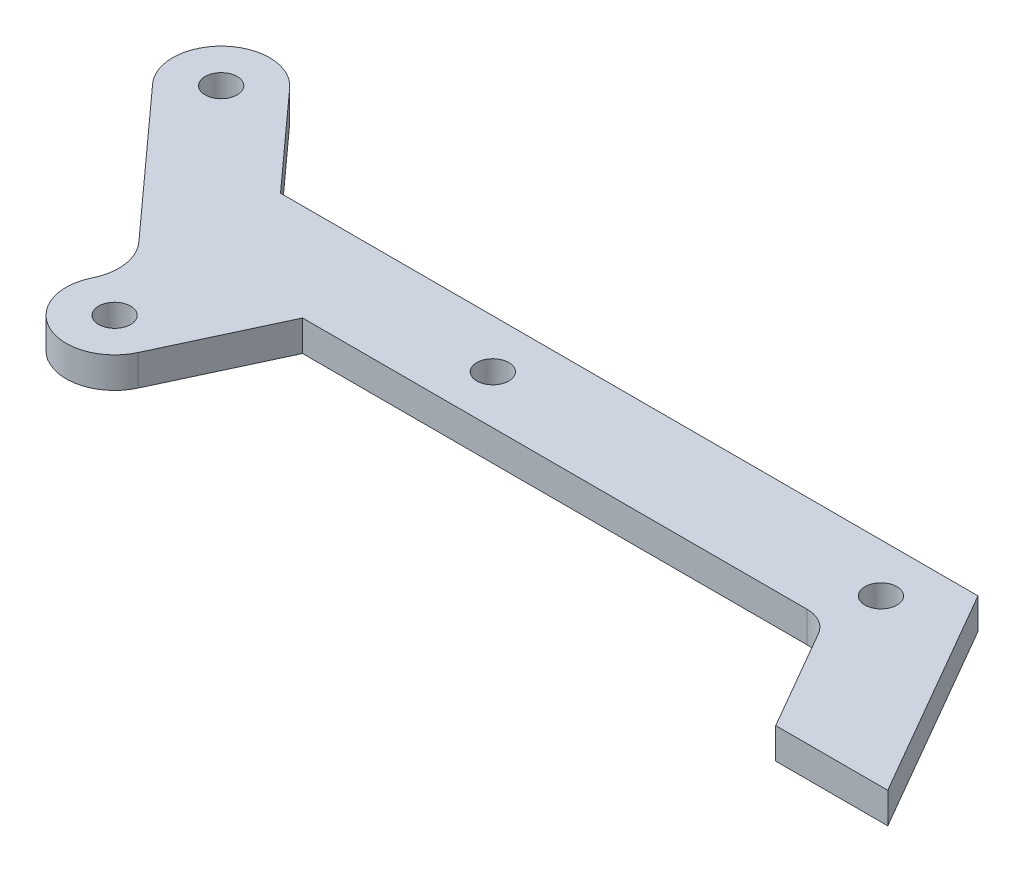
ISO-10303-21;
HEADER;
FILE_DESCRIPTION(('STEP AP214'),'2;1');
FILE_NAME('part.step','',(''),(''),'','','');
FILE_SCHEMA(('AUTOMOTIVE_DESIGN { 1 0 10303 214 1 1 1 1 }'));
ENDSEC;
DATA;
#1=APPLICATION_CONTEXT('core data for automotive mechanical design processes');
#2=APPLICATION_PROTOCOL_DEFINITION('international standard','automotive_design',2000,#1);
#3=PRODUCT_CONTEXT('',#1,'mechanical');
#4=PRODUCT('Part','Part','',(#3));
#5=PRODUCT_RELATED_PRODUCT_CATEGORY('part','',(#4));
#6=PRODUCT_DEFINITION_FORMATION('','',#4);
#7=PRODUCT_DEFINITION_CONTEXT('part definition',#1,'design');
#8=PRODUCT_DEFINITION('design','',#6,#7);
#9=PRODUCT_DEFINITION_SHAPE('','',#8);
#10=(LENGTH_UNIT() NAMED_UNIT(*) SI_UNIT(.MILLI.,.METRE.));
#11=(NAMED_UNIT(*) PLANE_ANGLE_UNIT() SI_UNIT($,.RADIAN.));
#12=(NAMED_UNIT(*) SI_UNIT($,.STERADIAN.) SOLID_ANGLE_UNIT());
#13=UNCERTAINTY_MEASURE_WITH_UNIT(LENGTH_MEASURE(1.E-05),#10,'distance_accuracy_value','');
#14=(GEOMETRIC_REPRESENTATION_CONTEXT(3) GLOBAL_UNCERTAINTY_ASSIGNED_CONTEXT((#13)) GLOBAL_UNIT_ASSIGNED_CONTEXT((#10,
#11,#12)) REPRESENTATION_CONTEXT('',''));
#15=CARTESIAN_POINT('',(0.,0.,0.));
#16=DIRECTION('',(0.,0.,1.));
#17=DIRECTION('',(1.,0.,0.));
#18=AXIS2_PLACEMENT_3D('',#15,#16,#17);
#19=CARTESIAN_POINT('',(0.,1.5875,0.));
#20=DIRECTION('',(-0.86602540378444,0.,0.499999999999998));
#21=DIRECTION('',(0.499999999999998,0.,0.86602540378444));
#22=AXIS2_PLACEMENT_3D('',#19,#20,#21);
#23=PLANE('',#22);
#24=DIRECTION('',(-0.499999999999998,0.,-0.86602540378444));
#25=VECTOR('',#24,1.);
#26=CARTESIAN_POINT('',(0.,-1.5875,0.));
#27=LINE('',#26,#25);
#28=CARTESIAN_POINT('',(0.,-1.5875,0.));
#29=VERTEX_POINT('',#28);
#30=CARTESIAN_POINT('',(-12.7017059221717,-1.5875,-22.));
#31=VERTEX_POINT('',#30);
#32=EDGE_CURVE('E185',#29,#31,#27,.T.);
#33=ORIENTED_EDGE('',*,*,#32,.T.);
#34=DIRECTION('',(0.,-1.,0.));
#35=VECTOR('',#34,1.);
#36=CARTESIAN_POINT('',(-12.7017059221717,1.5875,-22.));
#37=LINE('',#36,#35);
#38=CARTESIAN_POINT('',(-12.7017059221717,1.5875,-22.));
#39=VERTEX_POINT('',#38);
#40=EDGE_CURVE('E11',#39,#31,#37,.T.);
#41=ORIENTED_EDGE('',*,*,#40,.F.);
#42=DIRECTION('',(-0.499999999999998,0.,-0.86602540378444));
#43=VECTOR('',#42,1.);
#44=CARTESIAN_POINT('',(0.,1.5875,0.));
#45=LINE('',#44,#43);
#46=CARTESIAN_POINT('',(0.,1.5875,0.));
#47=VERTEX_POINT('',#46);
#48=EDGE_CURVE('E234',#47,#39,#45,.T.);
#49=ORIENTED_EDGE('',*,*,#48,.F.);
#50=DIRECTION('',(0.,-1.,0.));
#51=VECTOR('',#50,1.);
#52=CARTESIAN_POINT('',(0.,1.5875,0.));
#53=LINE('',#52,#51);
#54=EDGE_CURVE('E70',#47,#29,#53,.T.);
#55=ORIENTED_EDGE('',*,*,#54,.T.);
#56=EDGE_LOOP('',(#33,#41,#49,#55));
#57=FACE_BOUND('',#56,.T.);
#58=ADVANCED_FACE('F53',(#57),#23,.F.);
#59=CARTESIAN_POINT('',(-12.7017059221717,1.5875,-22.));
#60=DIRECTION('',(0.,0.,1.));
#61=DIRECTION('',(1.,0.,0.));
#62=AXIS2_PLACEMENT_3D('',#59,#60,#61);
#63=PLANE('',#62);
#64=DIRECTION('',(-1.,0.,0.));
#65=VECTOR('',#64,1.);
#66=CARTESIAN_POINT('',(-12.7017059221717,-1.5875,-22.));
#67=LINE('',#66,#65);
#68=CARTESIAN_POINT('',(-84.5798526734736,-1.5875,-22.));
#69=VERTEX_POINT('',#68);
#70=EDGE_CURVE('E188',#31,#69,#67,.T.);
#71=ORIENTED_EDGE('',*,*,#70,.T.);
#72=DIRECTION('',(0.,-1.,0.));
#73=VECTOR('',#72,1.);
#74=CARTESIAN_POINT('',(-84.5798526734736,1.5875,-22.));
#75=LINE('',#74,#73);
#76=CARTESIAN_POINT('',(-84.5798526734736,1.5875,-22.));
#77=VERTEX_POINT('',#76);
#78=EDGE_CURVE('E62',#77,#69,#75,.T.);
#79=ORIENTED_EDGE('',*,*,#78,.F.);
#80=DIRECTION('',(-1.,0.,0.));
#81=VECTOR('',#80,1.);
#82=CARTESIAN_POINT('',(-12.7017059221717,1.5875,-22.));
#83=LINE('',#82,#81);
#84=EDGE_CURVE('E123',#39,#77,#83,.T.);
#85=ORIENTED_EDGE('',*,*,#84,.F.);
#86=ORIENTED_EDGE('',*,*,#40,.T.);
#87=EDGE_LOOP('',(#71,#79,#85,#86));
#88=FACE_BOUND('',#87,.T.);
#89=ADVANCED_FACE('F268',(#88),#63,.F.);
#90=CARTESIAN_POINT('',(-93.5214059389944,1.5875,-31.8881721662102));
#91=DIRECTION('',(0.741718171528123,0.,-0.670711677268987));
#92=DIRECTION('',(-0.670711677268987,0.,-0.741718171528123));
#93=AXIS2_PLACEMENT_3D('',#90,#91,#92);
#94=PLANE('',#93);
#95=DIRECTION('',(0.670711677268987,0.,0.741718171528123));
#96=VECTOR('',#95,1.);
#97=CARTESIAN_POINT('',(-93.5214059389944,-1.5875,-31.8881721662102));
#98=LINE('',#97,#96);
#99=CARTESIAN_POINT('',(-93.5214059389944,-1.5875,-31.8881721662102));
#100=VERTEX_POINT('',#99);
#101=EDGE_CURVE('E193',#100,#69,#98,.T.);
#102=ORIENTED_EDGE('',*,*,#101,.F.);
#103=DIRECTION('',(0.,-1.,0.));
#104=VECTOR('',#103,1.);
#105=CARTESIAN_POINT('',(-93.5214059389944,1.5875,-31.8881721662102));
#106=LINE('',#105,#104);
#107=CARTESIAN_POINT('',(-93.5214059389944,1.5875,-31.8881721662102));
#108=VERTEX_POINT('',#107);
#109=EDGE_CURVE('E259',#108,#100,#106,.T.);
#110=ORIENTED_EDGE('',*,*,#109,.F.);
#111=DIRECTION('',(0.670711677268987,0.,0.741718171528123));
#112=VECTOR('',#111,1.);
#113=CARTESIAN_POINT('',(-93.5214059389944,1.5875,-31.8881721662102));
#114=LINE('',#113,#112);
#115=EDGE_CURVE('E267',#108,#77,#114,.T.);
#116=ORIENTED_EDGE('',*,*,#115,.T.);
#117=ORIENTED_EDGE('',*,*,#78,.T.);
#118=EDGE_LOOP('',(#102,#110,#116,#117));
#119=FACE_BOUND('',#118,.T.);
#120=ADVANCED_FACE('F265',(#119),#94,.T.);
#121=CARTESIAN_POINT('',(-97.2299968349116,1.5875,-28.5346138221942));
#122=DIRECTION('',(0.,-1.,0.));
#123=DIRECTION('',(0.,0.,-1.));
#124=AXIS2_PLACEMENT_3D('',#121,#122,#123);
#125=CYLINDRICAL_SURFACE('',#124,5.);
#126=CARTESIAN_POINT('',(-97.2299968349116,-1.5875,-28.5346138221942));
#127=DIRECTION('',(0.,1.,0.));
#128=DIRECTION('',(0.,0.,1.));
#129=AXIS2_PLACEMENT_3D('',#126,#127,#128);
#130=CIRCLE('',#129,5.);
#131=CARTESIAN_POINT('',(-100.938587730829,-1.5875,-25.1810554781781));
#132=VERTEX_POINT('',#131);
#133=EDGE_CURVE('E197',#100,#132,#130,.T.);
#134=ORIENTED_EDGE('',*,*,#133,.T.);
#135=DIRECTION('',(0.,-1.,0.));
#136=VECTOR('',#135,1.);
#137=CARTESIAN_POINT('',(-100.938587730829,1.5875,-25.1810554781781));
#138=LINE('',#137,#136);
#139=CARTESIAN_POINT('',(-100.938587730829,1.5875,-25.1810554781781));
#140=VERTEX_POINT('',#139);
#141=EDGE_CURVE('E256',#140,#132,#138,.T.);
#142=ORIENTED_EDGE('',*,*,#141,.F.);
#143=CARTESIAN_POINT('',(-97.2299968349116,1.5875,-28.5346138221942));
#144=DIRECTION('',(0.,1.,0.));
#145=DIRECTION('',(0.,0.,1.));
#146=AXIS2_PLACEMENT_3D('',#143,#144,#145);
#147=CIRCLE('',#146,5.);
#148=EDGE_CURVE('E279',#108,#140,#147,.T.);
#149=ORIENTED_EDGE('',*,*,#148,.F.);
#150=ORIENTED_EDGE('',*,*,#109,.T.);
#151=EDGE_LOOP('',(#134,#142,#149,#150));
#152=FACE_BOUND('',#151,.T.);
#153=ADVANCED_FACE('F276',(#152),#125,.T.);
#154=CARTESIAN_POINT('',(-87.4984644416117,1.5875,-10.3180614241881));
#155=DIRECTION('',(-0.741718171528123,0.,0.670711677268987));
#156=DIRECTION('',(0.670711677268987,0.,0.741718171528123));
#157=AXIS2_PLACEMENT_3D('',#154,#155,#156);
#158=PLANE('',#157);
#159=DIRECTION('',(-0.670711677268987,0.,-0.741718171528123));
#160=VECTOR('',#159,1.);
#161=CARTESIAN_POINT('',(-87.4984644416117,-1.5875,-10.3180614241881));
#162=LINE('',#161,#160);
#163=CARTESIAN_POINT('',(-87.4984644416117,-1.5875,-10.3180614241881));
#164=VERTEX_POINT('',#163);
#165=EDGE_CURVE('E201',#164,#132,#162,.T.);
#166=ORIENTED_EDGE('',*,*,#165,.F.);
#167=DIRECTION('',(0.,-1.,0.));
#168=VECTOR('',#167,1.);
#169=CARTESIAN_POINT('',(-87.4984644416117,1.5875,-10.3180614241881));
#170=LINE('',#169,#168);
#171=CARTESIAN_POINT('',(-87.4984644416117,1.5875,-10.3180614241881));
#172=VERTEX_POINT('',#171);
#173=EDGE_CURVE('E253',#172,#164,#170,.T.);
#174=ORIENTED_EDGE('',*,*,#173,.F.);
#175=DIRECTION('',(-0.670711677268987,0.,-0.741718171528123));
#176=VECTOR('',#175,1.);
#177=CARTESIAN_POINT('',(-87.4984644416117,1.5875,-10.3180614241881));
#178=LINE('',#177,#176);
#179=EDGE_CURVE('E282',#172,#140,#178,.T.);
#180=ORIENTED_EDGE('',*,*,#179,.T.);
#181=ORIENTED_EDGE('',*,*,#141,.T.);
#182=EDGE_LOOP('',(#166,#174,#180,#181));
#183=FACE_BOUND('',#182,.T.);
#184=ADVANCED_FACE('F538',(#183),#158,.T.);
#185=CARTESIAN_POINT('',(-91.2070552992523,1.5875,-6.96450303784312));
#186=DIRECTION('',(0.,-1.,0.));
#187=DIRECTION('',(0.,0.,-1.));
#188=AXIS2_PLACEMENT_3D('',#185,#186,#187);
#189=CYLINDRICAL_SURFACE('',#188,4.99999999999998);
#190=CARTESIAN_POINT('',(-91.2070552992523,-1.5875,-6.96450303784312));
#191=DIRECTION('',(0.,1.,0.));
#192=DIRECTION('',(0.,0.,1.));
#193=AXIS2_PLACEMENT_3D('',#190,#191,#192);
#194=CIRCLE('',#193,4.99999999999998);
#195=CARTESIAN_POINT('',(-86.6755163640691,-1.5875,-4.85141172913964));
#196=VERTEX_POINT('',#195);
#197=EDGE_CURVE('E205',#196,#164,#194,.T.);
#198=ORIENTED_EDGE('',*,*,#197,.F.);
#199=DIRECTION('',(0.,-1.,0.));
#200=VECTOR('',#199,1.);
#201=CARTESIAN_POINT('',(-86.6755163640691,1.5875,-4.85141172913964));
#202=LINE('',#201,#200);
#203=CARTESIAN_POINT('',(-86.6755163640691,1.5875,-4.85141172913964));
#204=VERTEX_POINT('',#203);
#205=EDGE_CURVE('E250',#204,#196,#202,.T.);
#206=ORIENTED_EDGE('',*,*,#205,.F.);
#207=CARTESIAN_POINT('',(-91.2070552992523,1.5875,-6.96450303784312));
#208=DIRECTION('',(0.,1.,0.));
#209=DIRECTION('',(0.,0.,1.));
#210=AXIS2_PLACEMENT_3D('',#207,#208,#209);
#211=CIRCLE('',#210,4.99999999999998);
#212=EDGE_CURVE('E292',#204,#172,#211,.T.);
#213=ORIENTED_EDGE('',*,*,#212,.T.);
#214=ORIENTED_EDGE('',*,*,#173,.T.);
#215=EDGE_LOOP('',(#198,#206,#213,#214));
#216=FACE_BOUND('',#215,.T.);
#217=ADVANCED_FACE('F528',(#216),#189,.F.);
#218=CARTESIAN_POINT('',(-86.7615355786813,1.5875,-4.666942928107));
#219=DIRECTION('',(-0.906307787036699,0.,-0.422618261740594));
#220=DIRECTION('',(-0.422618261740594,0.,0.906307787036699));
#221=AXIS2_PLACEMENT_3D('',#218,#219,#220);
#222=PLANE('',#221);
#223=DIRECTION('',(0.422618261740594,0.,-0.906307787036699));
#224=VECTOR('',#223,1.);
#225=CARTESIAN_POINT('',(-86.7615355786813,-1.5875,-4.666942928107));
#226=LINE('',#225,#224);
#227=CARTESIAN_POINT('',(-86.7615355786813,-1.5875,-4.666942928107));
#228=VERTEX_POINT('',#227);
#229=EDGE_CURVE('E209',#228,#196,#226,.T.);
#230=ORIENTED_EDGE('',*,*,#229,.F.);
#231=DIRECTION('',(0.,-1.,0.));
#232=VECTOR('',#231,1.);
#233=CARTESIAN_POINT('',(-86.7615355786813,1.5875,-4.666942928107));
#234=LINE('',#233,#232);
#235=CARTESIAN_POINT('',(-86.7615355786813,1.5875,-4.666942928107));
#236=VERTEX_POINT('',#235);
#237=EDGE_CURVE('E247',#236,#228,#234,.T.);
#238=ORIENTED_EDGE('',*,*,#237,.F.);
#239=DIRECTION('',(0.422618261740594,0.,-0.906307787036699));
#240=VECTOR('',#239,1.);
#241=CARTESIAN_POINT('',(-86.7615355786813,1.5875,-4.666942928107));
#242=LINE('',#241,#240);
#243=EDGE_CURVE('E296',#236,#204,#242,.T.);
#244=ORIENTED_EDGE('',*,*,#243,.T.);
#245=ORIENTED_EDGE('',*,*,#205,.T.);
#246=EDGE_LOOP('',(#230,#238,#244,#245));
#247=FACE_BOUND('',#246,.T.);
#248=ADVANCED_FACE('F518',(#247),#222,.T.);
#249=CARTESIAN_POINT('',(-82.2299968349115,1.5875,-2.55385170866107));
#250=DIRECTION('',(0.,-1.,0.));
#251=DIRECTION('',(0.,0.,-1.));
#252=AXIS2_PLACEMENT_3D('',#249,#250,#251);
#253=CYLINDRICAL_SURFACE('',#252,5.);
#254=CARTESIAN_POINT('',(-82.2299968349115,-1.5875,-2.55385170866107));
#255=DIRECTION('',(0.,-1.,0.));
#256=DIRECTION('',(0.,0.,-1.));
#257=AXIS2_PLACEMENT_3D('',#254,#255,#256);
#258=CIRCLE('',#257,5.);
#259=CARTESIAN_POINT('',(-77.6984578997282,-1.5875,-0.440760399957588));
#260=VERTEX_POINT('',#259);
#261=EDGE_CURVE('E213',#260,#228,#258,.T.);
#262=ORIENTED_EDGE('',*,*,#261,.F.);
#263=DIRECTION('',(0.,-1.,0.));
#264=VECTOR('',#263,1.);
#265=CARTESIAN_POINT('',(-77.6984578997282,1.5875,-0.440760399957588));
#266=LINE('',#265,#264);
#267=CARTESIAN_POINT('',(-77.6984578997282,1.5875,-0.440760399957588));
#268=VERTEX_POINT('',#267);
#269=EDGE_CURVE('E244',#268,#260,#266,.T.);
#270=ORIENTED_EDGE('',*,*,#269,.F.);
#271=CARTESIAN_POINT('',(-82.2299968349115,1.5875,-2.55385170866107));
#272=DIRECTION('',(0.,-1.,0.));
#273=DIRECTION('',(0.,0.,-1.));
#274=AXIS2_PLACEMENT_3D('',#271,#272,#273);
#275=CIRCLE('',#274,5.);
#276=EDGE_CURVE('E300',#268,#236,#275,.T.);
#277=ORIENTED_EDGE('',*,*,#276,.T.);
#278=ORIENTED_EDGE('',*,*,#237,.T.);
#279=EDGE_LOOP('',(#262,#270,#277,#278));
#280=FACE_BOUND('',#279,.T.);
#281=ADVANCED_FACE('F508',(#280),#253,.T.);
#282=CARTESIAN_POINT('',(-72.308295718745,1.5875,-12.));
#283=DIRECTION('',(0.906307787036651,0.,0.422618261740696));
#284=DIRECTION('',(0.422618261740697,0.,-0.906307787036651));
#285=AXIS2_PLACEMENT_3D('',#282,#283,#284);
#286=PLANE('',#285);
#287=DIRECTION('',(-0.422618261740697,0.,0.906307787036651));
#288=VECTOR('',#287,1.);
#289=CARTESIAN_POINT('',(-72.308295718745,-1.5875,-12.));
#290=LINE('',#289,#288);
#291=CARTESIAN_POINT('',(-72.308295718745,-1.5875,-12.));
#292=VERTEX_POINT('',#291);
#293=EDGE_CURVE('E217',#292,#260,#290,.T.);
#294=ORIENTED_EDGE('',*,*,#293,.F.);
#295=DIRECTION('',(0.,-1.,0.));
#296=VECTOR('',#295,1.);
#297=CARTESIAN_POINT('',(-72.308295718745,1.5875,-12.));
#298=LINE('',#297,#296);
#299=CARTESIAN_POINT('',(-72.308295718745,1.5875,-12.));
#300=VERTEX_POINT('',#299);
#301=EDGE_CURVE('E241',#300,#292,#298,.T.);
#302=ORIENTED_EDGE('',*,*,#301,.F.);
#303=DIRECTION('',(-0.422618261740697,0.,0.906307787036651));
#304=VECTOR('',#303,1.);
#305=CARTESIAN_POINT('',(-72.308295718745,1.5875,-12.));
#306=LINE('',#305,#304);
#307=EDGE_CURVE('E304',#300,#268,#306,.T.);
#308=ORIENTED_EDGE('',*,*,#307,.T.);
#309=ORIENTED_EDGE('',*,*,#269,.T.);
#310=EDGE_LOOP('',(#294,#302,#308,#309));
#311=FACE_BOUND('',#310,.T.);
#312=ADVANCED_FACE('F499',(#311),#286,.T.);
#313=CARTESIAN_POINT('',(-20.308295718745,1.5875,-12.));
#314=DIRECTION('',(0.,0.,1.));
#315=DIRECTION('',(1.,0.,0.));
#316=AXIS2_PLACEMENT_3D('',#313,#314,#315);
#317=PLANE('',#316);
#318=DIRECTION('',(-1.,0.,0.));
#319=VECTOR('',#318,1.);
#320=CARTESIAN_POINT('',(-20.308295718745,-1.5875,-12.));
#321=LINE('',#320,#319);
#322=CARTESIAN_POINT('',(-20.308295718745,-1.5875,-12.));
#323=VERTEX_POINT('',#322);
#324=EDGE_CURVE('E221',#323,#292,#321,.T.);
#325=ORIENTED_EDGE('',*,*,#324,.F.);
#326=DIRECTION('',(0.,-1.,0.));
#327=VECTOR('',#326,1.);
#328=CARTESIAN_POINT('',(-20.308295718745,1.5875,-12.));
#329=LINE('',#328,#327);
#330=CARTESIAN_POINT('',(-20.308295718745,1.5875,-12.));
#331=VERTEX_POINT('',#330);
#332=EDGE_CURVE('E164',#331,#323,#329,.T.);
#333=ORIENTED_EDGE('',*,*,#332,.F.);
#334=DIRECTION('',(-1.,0.,0.));
#335=VECTOR('',#334,1.);
#336=CARTESIAN_POINT('',(-20.308295718745,1.5875,-12.));
#337=LINE('',#336,#335);
#338=EDGE_CURVE('E174',#331,#300,#337,.T.);
#339=ORIENTED_EDGE('',*,*,#338,.T.);
#340=ORIENTED_EDGE('',*,*,#301,.T.);
#341=EDGE_LOOP('',(#325,#333,#339,#340));
#342=FACE_BOUND('',#341,.T.);
#343=ADVANCED_FACE('F310',(#342),#317,.T.);
#344=CARTESIAN_POINT('',(-20.308295718745,1.5875,-8.825));
#345=DIRECTION('',(0.,-1.,0.));
#346=DIRECTION('',(0.,0.,-1.));
#347=AXIS2_PLACEMENT_3D('',#344,#345,#346);
#348=CYLINDRICAL_SURFACE('',#347,3.175);
#349=CARTESIAN_POINT('',(-20.308295718745,-1.5875,-8.825));
#350=DIRECTION('',(0.,1.,0.));
#351=DIRECTION('',(0.,0.,1.));
#352=AXIS2_PLACEMENT_3D('',#349,#350,#351);
#353=CIRCLE('',#352,3.175);
#354=CARTESIAN_POINT('',(-17.5586650617294,-1.5875,-10.4125));
#355=VERTEX_POINT('',#354);
#356=EDGE_CURVE('E159',#355,#323,#353,.T.);
#357=ORIENTED_EDGE('',*,*,#356,.F.);
#358=DIRECTION('',(0.,-1.,0.));
#359=VECTOR('',#358,1.);
#360=CARTESIAN_POINT('',(-17.5586650617294,1.5875,-10.4125));
#361=LINE('',#360,#359);
#362=CARTESIAN_POINT('',(-17.5586650617294,1.5875,-10.4125));
#363=VERTEX_POINT('',#362);
#364=EDGE_CURVE('E154',#363,#355,#361,.T.);
#365=ORIENTED_EDGE('',*,*,#364,.F.);
#366=CARTESIAN_POINT('',(-20.308295718745,1.5875,-8.825));
#367=DIRECTION('',(0.,1.,0.));
#368=DIRECTION('',(0.,0.,1.));
#369=AXIS2_PLACEMENT_3D('',#366,#367,#368);
#370=CIRCLE('',#369,3.175);
#371=EDGE_CURVE('E157',#363,#331,#370,.T.);
#372=ORIENTED_EDGE('',*,*,#371,.T.);
#373=ORIENTED_EDGE('',*,*,#332,.T.);
#374=EDGE_LOOP('',(#357,#365,#372,#373));
#375=FACE_BOUND('',#374,.T.);
#376=ADVANCED_FACE('F156',(#375),#348,.F.);
#377=CARTESIAN_POINT('',(-11.5470053837925,1.5875,0.));
#378=DIRECTION('',(-0.86602540378444,0.,0.499999999999998));
#379=DIRECTION('',(0.499999999999998,0.,0.86602540378444));
#380=AXIS2_PLACEMENT_3D('',#377,#378,#379);
#381=PLANE('',#380);
#382=DIRECTION('',(-0.499999999999998,0.,-0.86602540378444));
#383=VECTOR('',#382,1.);
#384=CARTESIAN_POINT('',(-11.5470053837925,-1.5875,0.));
#385=LINE('',#384,#383);
#386=CARTESIAN_POINT('',(-11.5470053837925,-1.5875,0.));
#387=VERTEX_POINT('',#386);
#388=EDGE_CURVE('E227',#387,#355,#385,.T.);
#389=ORIENTED_EDGE('',*,*,#388,.F.);
#390=DIRECTION('',(0.,-1.,0.));
#391=VECTOR('',#390,1.);
#392=CARTESIAN_POINT('',(-11.5470053837925,1.5875,0.));
#393=LINE('',#392,#391);
#394=CARTESIAN_POINT('',(-11.5470053837925,1.5875,0.));
#395=VERTEX_POINT('',#394);
#396=EDGE_CURVE('E111',#395,#387,#393,.T.);
#397=ORIENTED_EDGE('',*,*,#396,.F.);
#398=DIRECTION('',(-0.499999999999998,0.,-0.86602540378444));
#399=VECTOR('',#398,1.);
#400=CARTESIAN_POINT('',(-11.5470053837925,1.5875,0.));
#401=LINE('',#400,#399);
#402=EDGE_CURVE('E171',#395,#363,#401,.T.);
#403=ORIENTED_EDGE('',*,*,#402,.T.);
#404=ORIENTED_EDGE('',*,*,#364,.T.);
#405=EDGE_LOOP('',(#389,#397,#403,#404));
#406=FACE_BOUND('',#405,.T.);
#407=ADVANCED_FACE('F177',(#406),#381,.T.);
#408=CARTESIAN_POINT('',(0.,1.5875,0.));
#409=DIRECTION('',(0.,0.,1.));
#410=DIRECTION('',(1.,0.,0.));
#411=AXIS2_PLACEMENT_3D('',#408,#409,#410);
#412=PLANE('',#411);
#413=DIRECTION('',(-1.,0.,0.));
#414=VECTOR('',#413,1.);
#415=CARTESIAN_POINT('',(0.,-1.5875,0.));
#416=LINE('',#415,#414);
#417=EDGE_CURVE('E230',#29,#387,#416,.T.);
#418=ORIENTED_EDGE('',*,*,#417,.F.);
#419=ORIENTED_EDGE('',*,*,#54,.F.);
#420=DIRECTION('',(-1.,0.,0.));
#421=VECTOR('',#420,1.);
#422=CARTESIAN_POINT('',(0.,1.5875,0.));
#423=LINE('',#422,#421);
#424=EDGE_CURVE('E179',#47,#395,#423,.T.);
#425=ORIENTED_EDGE('',*,*,#424,.T.);
#426=ORIENTED_EDGE('',*,*,#396,.T.);
#427=EDGE_LOOP('',(#418,#419,#425,#426));
#428=FACE_BOUND('',#427,.T.);
#429=ADVANCED_FACE('F312',(#428),#412,.T.);
#430=CARTESIAN_POINT('',(-97.2299968349116,1.5875,-28.5346138221942));
#431=DIRECTION('',(0.,1.,0.));
#432=DIRECTION('',(0.,0.,1.));
#433=AXIS2_PLACEMENT_3D('',#430,#431,#432);
#434=PLANE('',#433);
#435=CARTESIAN_POINT('',(-82.2299968349115,1.5875,-2.55385170866107));
#436=DIRECTION('',(0.,1.,0.));
#437=DIRECTION('',(0.,0.,1.));
#438=AXIS2_PLACEMENT_3D('',#435,#436,#437);
#439=CIRCLE('',#438,1.64999999999998);
#440=CARTESIAN_POINT('',(-82.2299968349115,1.5875,-0.903851708661086));
#441=VERTEX_POINT('',#440);
#442=EDGE_CURVE('E357',#441,#441,#439,.T.);
#443=ORIENTED_EDGE('',*,*,#442,.F.);
#444=EDGE_LOOP('',(#443));
#445=FACE_BOUND('',#444,.T.);
#446=CARTESIAN_POINT('',(-97.2299968349116,1.5875,-28.5346138221942));
#447=DIRECTION('',(0.,1.,0.));
#448=DIRECTION('',(0.,0.,1.));
#449=AXIS2_PLACEMENT_3D('',#446,#447,#448);
#450=CIRCLE('',#449,1.64999999999998);
#451=CARTESIAN_POINT('',(-97.2299968349116,1.5875,-26.8846138221942));
#452=VERTEX_POINT('',#451);
#453=EDGE_CURVE('E349',#452,#452,#450,.T.);
#454=ORIENTED_EDGE('',*,*,#453,.F.);
#455=EDGE_LOOP('',(#454));
#456=FACE_BOUND('',#455,.T.);
#457=CARTESIAN_POINT('',(-17.7017059221717,1.5875,-17.));
#458=DIRECTION('',(0.,1.,0.));
#459=DIRECTION('',(0.,0.,1.));
#460=AXIS2_PLACEMENT_3D('',#457,#458,#459);
#461=CIRCLE('',#460,1.65);
#462=CARTESIAN_POINT('',(-17.7017059221717,1.5875,-15.35));
#463=VERTEX_POINT('',#462);
#464=EDGE_CURVE('E341',#463,#463,#461,.T.);
#465=ORIENTED_EDGE('',*,*,#464,.F.);
#466=EDGE_LOOP('',(#465));
#467=FACE_BOUND('',#466,.T.);
#468=CARTESIAN_POINT('',(-57.7017059221717,1.5875,-17.));
#469=DIRECTION('',(0.,1.,0.));
#470=DIRECTION('',(0.,0.,1.));
#471=AXIS2_PLACEMENT_3D('',#468,#469,#470);
#472=CIRCLE('',#471,1.65);
#473=CARTESIAN_POINT('',(-57.7017059221717,1.5875,-15.35));
#474=VERTEX_POINT('',#473);
#475=EDGE_CURVE('E333',#474,#474,#472,.T.);
#476=ORIENTED_EDGE('',*,*,#475,.F.);
#477=EDGE_LOOP('',(#476));
#478=FACE_BOUND('',#477,.T.);
#479=ORIENTED_EDGE('',*,*,#48,.T.);
#480=ORIENTED_EDGE('',*,*,#84,.T.);
#481=ORIENTED_EDGE('',*,*,#115,.F.);
#482=ORIENTED_EDGE('',*,*,#148,.T.);
#483=ORIENTED_EDGE('',*,*,#179,.F.);
#484=ORIENTED_EDGE('',*,*,#212,.F.);
#485=ORIENTED_EDGE('',*,*,#243,.F.);
#486=ORIENTED_EDGE('',*,*,#276,.F.);
#487=ORIENTED_EDGE('',*,*,#307,.F.);
#488=ORIENTED_EDGE('',*,*,#338,.F.);
#489=ORIENTED_EDGE('',*,*,#371,.F.);
#490=ORIENTED_EDGE('',*,*,#402,.F.);
#491=ORIENTED_EDGE('',*,*,#424,.F.);
#492=EDGE_LOOP('',(#479,#480,#481,#482,#483,#484,#485,#486,#487,#488,#489,#490,#491));
#493=FACE_BOUND('',#492,.T.);
#494=ADVANCED_FACE('F169',(#445,#456,#467,#478,#493),#434,.T.);
#495=CARTESIAN_POINT('',(-97.2299968349116,-1.5875,-28.5346138221942));
#496=DIRECTION('',(0.,1.,0.));
#497=DIRECTION('',(0.,0.,1.));
#498=AXIS2_PLACEMENT_3D('',#495,#496,#497);
#499=PLANE('',#498);
#500=CARTESIAN_POINT('',(-82.2299968349115,-1.5875,-2.55385170866107));
#501=DIRECTION('',(0.,1.,0.));
#502=DIRECTION('',(0.,0.,1.));
#503=AXIS2_PLACEMENT_3D('',#500,#501,#502);
#504=CIRCLE('',#503,1.65);
#505=CARTESIAN_POINT('',(-82.2299968349115,-1.5875,-0.903851708661072));
#506=VERTEX_POINT('',#505);
#507=EDGE_CURVE('E353',#506,#506,#504,.T.);
#508=ORIENTED_EDGE('',*,*,#507,.T.);
#509=EDGE_LOOP('',(#508));
#510=FACE_BOUND('',#509,.T.);
#511=CARTESIAN_POINT('',(-97.2299968349116,-1.5875,-28.5346138221942));
#512=DIRECTION('',(0.,1.,0.));
#513=DIRECTION('',(0.,0.,1.));
#514=AXIS2_PLACEMENT_3D('',#511,#512,#513);
#515=CIRCLE('',#514,1.65);
#516=CARTESIAN_POINT('',(-97.2299968349116,-1.5875,-26.8846138221942));
#517=VERTEX_POINT('',#516);
#518=EDGE_CURVE('E345',#517,#517,#515,.T.);
#519=ORIENTED_EDGE('',*,*,#518,.T.);
#520=EDGE_LOOP('',(#519));
#521=FACE_BOUND('',#520,.T.);
#522=CARTESIAN_POINT('',(-17.7017059221717,-1.5875,-17.));
#523=DIRECTION('',(0.,1.,0.));
#524=DIRECTION('',(0.,0.,1.));
#525=AXIS2_PLACEMENT_3D('',#522,#523,#524);
#526=CIRCLE('',#525,1.65);
#527=CARTESIAN_POINT('',(-17.7017059221717,-1.5875,-15.35));
#528=VERTEX_POINT('',#527);
#529=EDGE_CURVE('E337',#528,#528,#526,.T.);
#530=ORIENTED_EDGE('',*,*,#529,.T.);
#531=EDGE_LOOP('',(#530));
#532=FACE_BOUND('',#531,.T.);
#533=CARTESIAN_POINT('',(-57.7017059221717,-1.5875,-17.));
#534=DIRECTION('',(0.,1.,0.));
#535=DIRECTION('',(0.,0.,1.));
#536=AXIS2_PLACEMENT_3D('',#533,#534,#535);
#537=CIRCLE('',#536,1.65);
#538=CARTESIAN_POINT('',(-57.7017059221717,-1.5875,-15.35));
#539=VERTEX_POINT('',#538);
#540=EDGE_CURVE('E189',#539,#539,#537,.T.);
#541=ORIENTED_EDGE('',*,*,#540,.T.);
#542=EDGE_LOOP('',(#541));
#543=FACE_BOUND('',#542,.T.);
#544=ORIENTED_EDGE('',*,*,#32,.F.);
#545=ORIENTED_EDGE('',*,*,#417,.T.);
#546=ORIENTED_EDGE('',*,*,#388,.T.);
#547=ORIENTED_EDGE('',*,*,#356,.T.);
#548=ORIENTED_EDGE('',*,*,#324,.T.);
#549=ORIENTED_EDGE('',*,*,#293,.T.);
#550=ORIENTED_EDGE('',*,*,#261,.T.);
#551=ORIENTED_EDGE('',*,*,#229,.T.);
#552=ORIENTED_EDGE('',*,*,#197,.T.);
#553=ORIENTED_EDGE('',*,*,#165,.T.);
#554=ORIENTED_EDGE('',*,*,#133,.F.);
#555=ORIENTED_EDGE('',*,*,#101,.T.);
#556=ORIENTED_EDGE('',*,*,#70,.F.);
#557=EDGE_LOOP('',(#544,#545,#546,#547,#548,#549,#550,#551,#552,#553,#554,#555,#556));
#558=FACE_BOUND('',#557,.T.);
#559=ADVANCED_FACE('F272',(#510,#521,#532,#543,#558),#499,.F.);
#560=CARTESIAN_POINT('',(-57.7017059221717,1.5875,-17.));
#561=DIRECTION('',(0.,1.,0.));
#562=DIRECTION('',(0.,0.,1.));
#563=AXIS2_PLACEMENT_3D('',#560,#561,#562);
#564=CYLINDRICAL_SURFACE('',#563,1.65);
#565=ORIENTED_EDGE('',*,*,#540,.F.);
#566=EDGE_LOOP('',(#565));
#567=FACE_BOUND('',#566,.T.);
#568=ORIENTED_EDGE('',*,*,#475,.T.);
#569=EDGE_LOOP('',(#568));
#570=FACE_BOUND('',#569,.T.);
#571=ADVANCED_FACE('F370',(#567,#570),#564,.F.);
#572=CARTESIAN_POINT('',(-17.7017059221717,1.5875,-17.));
#573=DIRECTION('',(0.,1.,0.));
#574=DIRECTION('',(0.,0.,1.));
#575=AXIS2_PLACEMENT_3D('',#572,#573,#574);
#576=CYLINDRICAL_SURFACE('',#575,1.65);
#577=ORIENTED_EDGE('',*,*,#529,.F.);
#578=EDGE_LOOP('',(#577));
#579=FACE_BOUND('',#578,.T.);
#580=ORIENTED_EDGE('',*,*,#464,.T.);
#581=EDGE_LOOP('',(#580));
#582=FACE_BOUND('',#581,.T.);
#583=ADVANCED_FACE('F372',(#579,#582),#576,.F.);
#584=CARTESIAN_POINT('',(-97.2299968349116,1.5875,-28.5346138221942));
#585=DIRECTION('',(0.,1.,0.));
#586=DIRECTION('',(0.,0.,1.));
#587=AXIS2_PLACEMENT_3D('',#584,#585,#586);
#588=CYLINDRICAL_SURFACE('',#587,1.64999999999999);
#589=ORIENTED_EDGE('',*,*,#518,.F.);
#590=EDGE_LOOP('',(#589));
#591=FACE_BOUND('',#590,.T.);
#592=ORIENTED_EDGE('',*,*,#453,.T.);
#593=EDGE_LOOP('',(#592));
#594=FACE_BOUND('',#593,.T.);
#595=ADVANCED_FACE('F378',(#591,#594),#588,.F.);
#596=CARTESIAN_POINT('',(-82.2299968349115,1.5875,-2.55385170866107));
#597=DIRECTION('',(0.,1.,0.));
#598=DIRECTION('',(0.,0.,1.));
#599=AXIS2_PLACEMENT_3D('',#596,#597,#598);
#600=CYLINDRICAL_SURFACE('',#599,1.64999999999999);
#601=ORIENTED_EDGE('',*,*,#507,.F.);
#602=EDGE_LOOP('',(#601));
#603=FACE_BOUND('',#602,.T.);
#604=ORIENTED_EDGE('',*,*,#442,.T.);
#605=EDGE_LOOP('',(#604));
#606=FACE_BOUND('',#605,.T.);
#607=ADVANCED_FACE('F362',(#603,#606),#600,.F.);
#608=CLOSED_SHELL('',(#58,#89,#120,#153,#184,#217,#248,#281,#312,#343,#376,#407,#429,#494,#559,
#571,#583,#595,#607));
#609=MANIFOLD_SOLID_BREP('B2',#608);
#610=ADVANCED_BREP_SHAPE_REPRESENTATION('',(#18,#609),#14);
#611=SHAPE_DEFINITION_REPRESENTATION(#9,#610);
ENDSEC;
END-ISO-10303-21;
